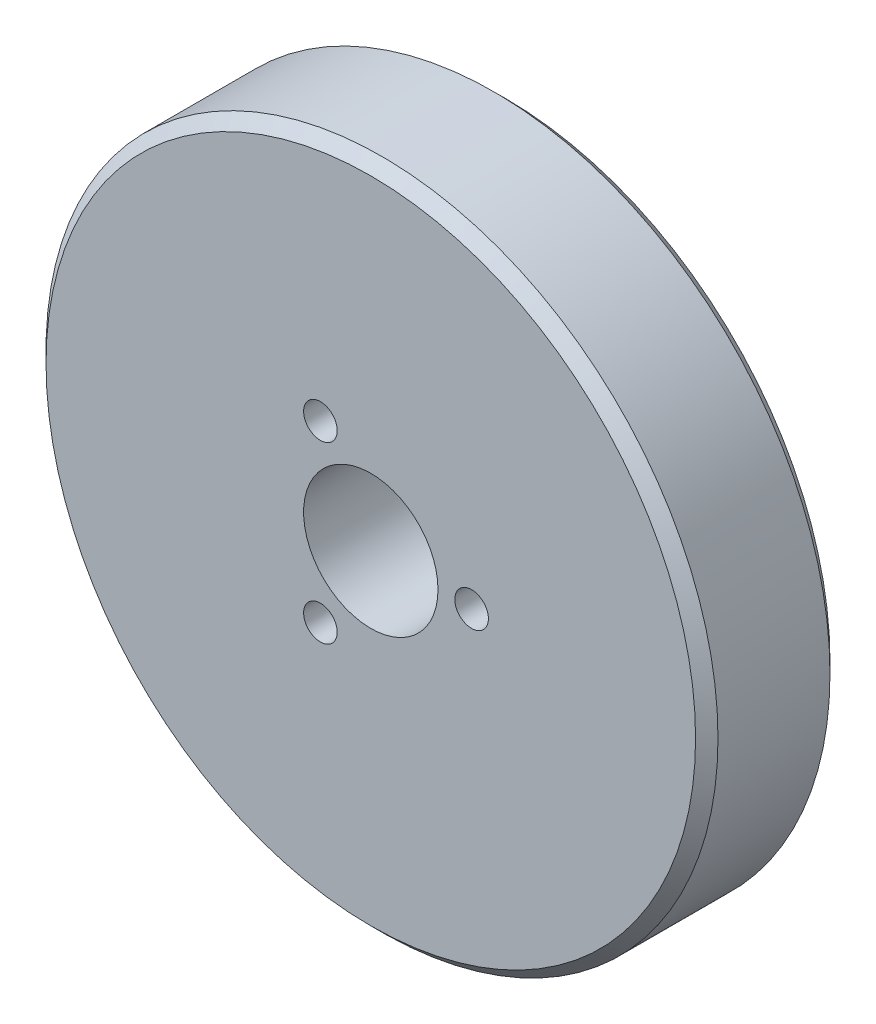
ISO-10303-21;
HEADER;
FILE_DESCRIPTION(('STEP AP214'),'2;1');
FILE_NAME('part.step','',(''),(''),'','','');
FILE_SCHEMA(('AUTOMOTIVE_DESIGN { 1 0 10303 214 1 1 1 1 }'));
ENDSEC;
DATA;
#1=APPLICATION_CONTEXT('core data for automotive mechanical design processes');
#2=APPLICATION_PROTOCOL_DEFINITION('international standard','automotive_design',2000,#1);
#3=PRODUCT_CONTEXT('',#1,'mechanical');
#4=PRODUCT('Part','Part','',(#3));
#5=PRODUCT_RELATED_PRODUCT_CATEGORY('part','',(#4));
#6=PRODUCT_DEFINITION_FORMATION('','',#4);
#7=PRODUCT_DEFINITION_CONTEXT('part definition',#1,'design');
#8=PRODUCT_DEFINITION('design','',#6,#7);
#9=PRODUCT_DEFINITION_SHAPE('','',#8);
#10=(LENGTH_UNIT() NAMED_UNIT(*) SI_UNIT(.MILLI.,.METRE.));
#11=(NAMED_UNIT(*) PLANE_ANGLE_UNIT() SI_UNIT($,.RADIAN.));
#12=(NAMED_UNIT(*) SI_UNIT($,.STERADIAN.) SOLID_ANGLE_UNIT());
#13=UNCERTAINTY_MEASURE_WITH_UNIT(LENGTH_MEASURE(1.E-05),#10,'distance_accuracy_value','');
#14=(GEOMETRIC_REPRESENTATION_CONTEXT(3) GLOBAL_UNCERTAINTY_ASSIGNED_CONTEXT((#13)) GLOBAL_UNIT_ASSIGNED_CONTEXT((#10,
#11,#12)) REPRESENTATION_CONTEXT('',''));
#15=CARTESIAN_POINT('',(0.,0.,0.));
#16=DIRECTION('',(0.,0.,1.));
#17=DIRECTION('',(1.,0.,0.));
#18=AXIS2_PLACEMENT_3D('',#15,#16,#17);
#19=CARTESIAN_POINT('',(0.,0.,12.));
#20=DIRECTION('',(0.,0.,1.));
#21=DIRECTION('',(1.,0.,0.));
#22=AXIS2_PLACEMENT_3D('',#19,#20,#21);
#23=PLANE('',#22);
#24=CARTESIAN_POINT('',(0.,0.,12.));
#25=DIRECTION('',(0.,0.,1.));
#26=DIRECTION('',(1.,0.,0.));
#27=AXIS2_PLACEMENT_3D('',#24,#25,#26);
#28=CIRCLE('',#27,29.);
#29=CARTESIAN_POINT('',(29.,0.,12.));
#30=VERTEX_POINT('',#29);
#31=EDGE_CURVE('E10',#30,#30,#28,.T.);
#32=ORIENTED_EDGE('',*,*,#31,.T.);
#33=EDGE_LOOP('',(#32));
#34=FACE_BOUND('',#33,.T.);
#35=CARTESIAN_POINT('',(-4.50000000000004,-7.79422863405993,12.));
#36=DIRECTION('',(0.,0.,1.));
#37=DIRECTION('',(1.,0.,0.));
#38=AXIS2_PLACEMENT_3D('',#35,#36,#37);
#39=CIRCLE('',#38,1.5);
#40=CARTESIAN_POINT('',(-3.00000000000004,-7.79422863405993,12.));
#41=VERTEX_POINT('',#40);
#42=EDGE_CURVE('E61',#41,#41,#39,.T.);
#43=ORIENTED_EDGE('',*,*,#42,.F.);
#44=EDGE_LOOP('',(#43));
#45=FACE_BOUND('',#44,.T.);
#46=CARTESIAN_POINT('',(0.,0.,12.));
#47=DIRECTION('',(0.,0.,1.));
#48=DIRECTION('',(1.,0.,0.));
#49=AXIS2_PLACEMENT_3D('',#46,#47,#48);
#50=CIRCLE('',#49,6.);
#51=CARTESIAN_POINT('',(6.,0.,12.));
#52=VERTEX_POINT('',#51);
#53=EDGE_CURVE('E51',#52,#52,#50,.T.);
#54=ORIENTED_EDGE('',*,*,#53,.F.);
#55=EDGE_LOOP('',(#54));
#56=FACE_BOUND('',#55,.T.);
#57=CARTESIAN_POINT('',(9.,0.,12.));
#58=DIRECTION('',(0.,0.,1.));
#59=DIRECTION('',(1.,0.,0.));
#60=AXIS2_PLACEMENT_3D('',#57,#58,#59);
#61=CIRCLE('',#60,1.5);
#62=CARTESIAN_POINT('',(10.5,0.,12.));
#63=VERTEX_POINT('',#62);
#64=EDGE_CURVE('E55',#63,#63,#61,.T.);
#65=ORIENTED_EDGE('',*,*,#64,.F.);
#66=EDGE_LOOP('',(#65));
#67=FACE_BOUND('',#66,.T.);
#68=CARTESIAN_POINT('',(-4.49999999999993,7.79422863405999,12.));
#69=DIRECTION('',(0.,0.,1.));
#70=DIRECTION('',(1.,0.,0.));
#71=AXIS2_PLACEMENT_3D('',#68,#69,#70);
#72=CIRCLE('',#71,1.5);
#73=CARTESIAN_POINT('',(-2.99999999999993,7.79422863405999,12.));
#74=VERTEX_POINT('',#73);
#75=EDGE_CURVE('E67',#74,#74,#72,.T.);
#76=ORIENTED_EDGE('',*,*,#75,.F.);
#77=EDGE_LOOP('',(#76));
#78=FACE_BOUND('',#77,.T.);
#79=ADVANCED_FACE('F31',(#34,#45,#56,#67,#78),#23,.T.);
#80=CARTESIAN_POINT('',(0.,0.,0.));
#81=DIRECTION('',(0.,0.,1.));
#82=DIRECTION('',(1.,0.,0.));
#83=AXIS2_PLACEMENT_3D('',#80,#81,#82);
#84=PLANE('',#83);
#85=CARTESIAN_POINT('',(0.,0.,0.));
#86=DIRECTION('',(0.,0.,1.));
#87=DIRECTION('',(1.,0.,0.));
#88=AXIS2_PLACEMENT_3D('',#85,#86,#87);
#89=CIRCLE('',#88,29.);
#90=CARTESIAN_POINT('',(29.,0.,0.));
#91=VERTEX_POINT('',#90);
#92=EDGE_CURVE('E38',#91,#91,#89,.F.);
#93=ORIENTED_EDGE('',*,*,#92,.T.);
#94=EDGE_LOOP('',(#93));
#95=FACE_BOUND('',#94,.T.);
#96=CARTESIAN_POINT('',(0.,0.,0.));
#97=DIRECTION('',(0.,0.,1.));
#98=DIRECTION('',(1.,0.,0.));
#99=AXIS2_PLACEMENT_3D('',#96,#97,#98);
#100=CIRCLE('',#99,6.);
#101=CARTESIAN_POINT('',(6.,0.,0.));
#102=VERTEX_POINT('',#101);
#103=EDGE_CURVE('E52',#102,#102,#100,.T.);
#104=ORIENTED_EDGE('',*,*,#103,.T.);
#105=EDGE_LOOP('',(#104));
#106=FACE_BOUND('',#105,.T.);
#107=CARTESIAN_POINT('',(9.,0.,0.));
#108=DIRECTION('',(0.,0.,1.));
#109=DIRECTION('',(1.,0.,0.));
#110=AXIS2_PLACEMENT_3D('',#107,#108,#109);
#111=CIRCLE('',#110,1.5);
#112=CARTESIAN_POINT('',(10.5,0.,0.));
#113=VERTEX_POINT('',#112);
#114=EDGE_CURVE('E58',#113,#113,#111,.T.);
#115=ORIENTED_EDGE('',*,*,#114,.T.);
#116=EDGE_LOOP('',(#115));
#117=FACE_BOUND('',#116,.T.);
#118=CARTESIAN_POINT('',(-4.50000000000004,-7.79422863405993,0.));
#119=DIRECTION('',(0.,0.,1.));
#120=DIRECTION('',(1.,0.,0.));
#121=AXIS2_PLACEMENT_3D('',#118,#119,#120);
#122=CIRCLE('',#121,1.5);
#123=CARTESIAN_POINT('',(-3.00000000000004,-7.79422863405993,0.));
#124=VERTEX_POINT('',#123);
#125=EDGE_CURVE('E64',#124,#124,#122,.T.);
#126=ORIENTED_EDGE('',*,*,#125,.T.);
#127=EDGE_LOOP('',(#126));
#128=FACE_BOUND('',#127,.T.);
#129=CARTESIAN_POINT('',(-4.49999999999993,7.79422863405999,0.));
#130=DIRECTION('',(0.,0.,1.));
#131=DIRECTION('',(1.,0.,0.));
#132=AXIS2_PLACEMENT_3D('',#129,#130,#131);
#133=CIRCLE('',#132,1.5);
#134=CARTESIAN_POINT('',(-2.99999999999993,7.79422863405999,0.));
#135=VERTEX_POINT('',#134);
#136=EDGE_CURVE('E70',#135,#135,#133,.T.);
#137=ORIENTED_EDGE('',*,*,#136,.T.);
#138=EDGE_LOOP('',(#137));
#139=FACE_BOUND('',#138,.T.);
#140=ADVANCED_FACE('F80',(#95,#106,#117,#128,#139),#84,.F.);
#141=CARTESIAN_POINT('',(0.,0.,12.));
#142=DIRECTION('',(0.,0.,-1.));
#143=DIRECTION('',(-1.,0.,0.));
#144=AXIS2_PLACEMENT_3D('',#141,#142,#143);
#145=CYLINDRICAL_SURFACE('',#144,30.);
#146=CARTESIAN_POINT('',(0.,0.,0.999999999999984));
#147=DIRECTION('',(0.,0.,1.));
#148=DIRECTION('',(1.,0.,0.));
#149=AXIS2_PLACEMENT_3D('',#146,#147,#148);
#150=CIRCLE('',#149,30.);
#151=CARTESIAN_POINT('',(30.,0.,0.999999999999984));
#152=VERTEX_POINT('',#151);
#153=EDGE_CURVE('E42',#152,#152,#150,.T.);
#154=ORIENTED_EDGE('',*,*,#153,.T.);
#155=EDGE_LOOP('',(#154));
#156=FACE_BOUND('',#155,.T.);
#157=CARTESIAN_POINT('',(0.,0.,11.));
#158=DIRECTION('',(0.,0.,1.));
#159=DIRECTION('',(1.,0.,0.));
#160=AXIS2_PLACEMENT_3D('',#157,#158,#159);
#161=CIRCLE('',#160,30.);
#162=CARTESIAN_POINT('',(30.,0.,11.));
#163=VERTEX_POINT('',#162);
#164=EDGE_CURVE('E46',#163,#163,#161,.F.);
#165=ORIENTED_EDGE('',*,*,#164,.T.);
#166=EDGE_LOOP('',(#165));
#167=FACE_BOUND('',#166,.T.);
#168=ADVANCED_FACE('F85',(#156,#167),#145,.T.);
#169=CARTESIAN_POINT('',(0.,0.,12.));
#170=DIRECTION('',(0.,0.,-1.));
#171=DIRECTION('',(-1.,0.,0.));
#172=AXIS2_PLACEMENT_3D('',#169,#170,#171);
#173=CYLINDRICAL_SURFACE('',#172,6.);
#174=ORIENTED_EDGE('',*,*,#53,.T.);
#175=EDGE_LOOP('',(#174));
#176=FACE_BOUND('',#175,.T.);
#177=ORIENTED_EDGE('',*,*,#103,.F.);
#178=EDGE_LOOP('',(#177));
#179=FACE_BOUND('',#178,.T.);
#180=ADVANCED_FACE('F89',(#176,#179),#173,.F.);
#181=CARTESIAN_POINT('',(9.,0.,12.));
#182=DIRECTION('',(0.,0.,-1.));
#183=DIRECTION('',(-1.,0.,0.));
#184=AXIS2_PLACEMENT_3D('',#181,#182,#183);
#185=CYLINDRICAL_SURFACE('',#184,1.5);
#186=ORIENTED_EDGE('',*,*,#64,.T.);
#187=EDGE_LOOP('',(#186));
#188=FACE_BOUND('',#187,.T.);
#189=ORIENTED_EDGE('',*,*,#114,.F.);
#190=EDGE_LOOP('',(#189));
#191=FACE_BOUND('',#190,.T.);
#192=ADVANCED_FACE('F112',(#188,#191),#185,.F.);
#193=CARTESIAN_POINT('',(-4.50000000000004,-7.79422863405993,12.));
#194=DIRECTION('',(0.,0.,-1.));
#195=DIRECTION('',(-1.,0.,0.));
#196=AXIS2_PLACEMENT_3D('',#193,#194,#195);
#197=CYLINDRICAL_SURFACE('',#196,1.5);
#198=ORIENTED_EDGE('',*,*,#42,.T.);
#199=EDGE_LOOP('',(#198));
#200=FACE_BOUND('',#199,.T.);
#201=ORIENTED_EDGE('',*,*,#125,.F.);
#202=EDGE_LOOP('',(#201));
#203=FACE_BOUND('',#202,.T.);
#204=ADVANCED_FACE('F102',(#200,#203),#197,.F.);
#205=CARTESIAN_POINT('',(-4.49999999999993,7.79422863405999,12.));
#206=DIRECTION('',(0.,0.,-1.));
#207=DIRECTION('',(-1.,0.,0.));
#208=AXIS2_PLACEMENT_3D('',#205,#206,#207);
#209=CYLINDRICAL_SURFACE('',#208,1.5);
#210=ORIENTED_EDGE('',*,*,#75,.T.);
#211=EDGE_LOOP('',(#210));
#212=FACE_BOUND('',#211,.T.);
#213=ORIENTED_EDGE('',*,*,#136,.F.);
#214=EDGE_LOOP('',(#213));
#215=FACE_BOUND('',#214,.T.);
#216=ADVANCED_FACE('F76',(#212,#215),#209,.F.);
#217=CARTESIAN_POINT('',(0.,0.,0.999999999999984));
#218=DIRECTION('',(0.,0.,1.));
#219=DIRECTION('',(1.,0.,0.));
#220=AXIS2_PLACEMENT_3D('',#217,#218,#219);
#221=CONICAL_SURFACE('',#220,30.,0.785398163397452);
#222=ORIENTED_EDGE('',*,*,#92,.F.);
#223=EDGE_LOOP('',(#222));
#224=FACE_BOUND('',#223,.T.);
#225=ORIENTED_EDGE('',*,*,#153,.F.);
#226=EDGE_LOOP('',(#225));
#227=FACE_BOUND('',#226,.T.);
#228=ADVANCED_FACE('F94',(#224,#227),#221,.T.);
#229=CARTESIAN_POINT('',(0.,0.,12.));
#230=DIRECTION('',(0.,0.,-1.));
#231=DIRECTION('',(-1.,0.,0.));
#232=AXIS2_PLACEMENT_3D('',#229,#230,#231);
#233=CONICAL_SURFACE('',#232,29.,0.785398163397447);
#234=ORIENTED_EDGE('',*,*,#164,.F.);
#235=EDGE_LOOP('',(#234));
#236=FACE_BOUND('',#235,.T.);
#237=ORIENTED_EDGE('',*,*,#31,.F.);
#238=EDGE_LOOP('',(#237));
#239=FACE_BOUND('',#238,.T.);
#240=ADVANCED_FACE('F33',(#236,#239),#233,.T.);
#241=CLOSED_SHELL('',(#79,#140,#168,#180,#192,#204,#216,#228,#240));
#242=MANIFOLD_SOLID_BREP('B2',#241);
#243=ADVANCED_BREP_SHAPE_REPRESENTATION('',(#18,#242),#14);
#244=SHAPE_DEFINITION_REPRESENTATION(#9,#243);
ENDSEC;
END-ISO-10303-21;
